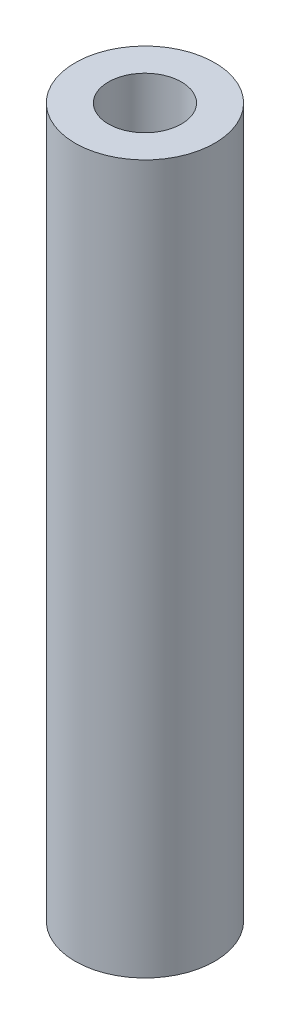
ISO-10303-21;
HEADER;
FILE_DESCRIPTION(('STEP AP214'),'2;1');
FILE_NAME('part.step','',(''),(''),'','','');
FILE_SCHEMA(('AUTOMOTIVE_DESIGN { 1 0 10303 214 1 1 1 1 }'));
ENDSEC;
DATA;
#1=APPLICATION_CONTEXT('core data for automotive mechanical design processes');
#2=APPLICATION_PROTOCOL_DEFINITION('international standard','automotive_design',2000,#1);
#3=PRODUCT_CONTEXT('',#1,'mechanical');
#4=PRODUCT('Part','Part','',(#3));
#5=PRODUCT_RELATED_PRODUCT_CATEGORY('part','',(#4));
#6=PRODUCT_DEFINITION_FORMATION('','',#4);
#7=PRODUCT_DEFINITION_CONTEXT('part definition',#1,'design');
#8=PRODUCT_DEFINITION('design','',#6,#7);
#9=PRODUCT_DEFINITION_SHAPE('','',#8);
#10=(LENGTH_UNIT() NAMED_UNIT(*) SI_UNIT(.MILLI.,.METRE.));
#11=(NAMED_UNIT(*) PLANE_ANGLE_UNIT() SI_UNIT($,.RADIAN.));
#12=(NAMED_UNIT(*) SI_UNIT($,.STERADIAN.) SOLID_ANGLE_UNIT());
#13=UNCERTAINTY_MEASURE_WITH_UNIT(LENGTH_MEASURE(1.E-05),#10,'distance_accuracy_value','');
#14=(GEOMETRIC_REPRESENTATION_CONTEXT(3) GLOBAL_UNCERTAINTY_ASSIGNED_CONTEXT((#13)) GLOBAL_UNIT_ASSIGNED_CONTEXT((#10,
#11,#12)) REPRESENTATION_CONTEXT('',''));
#15=CARTESIAN_POINT('',(0.,0.,0.));
#16=DIRECTION('',(0.,0.,1.));
#17=DIRECTION('',(1.,0.,0.));
#18=AXIS2_PLACEMENT_3D('',#15,#16,#17);
#19=CARTESIAN_POINT('',(0.,33.,0.));
#20=DIRECTION('',(0.,1.,0.));
#21=DIRECTION('',(0.,0.,1.));
#22=AXIS2_PLACEMENT_3D('',#19,#20,#21);
#23=PLANE('',#22);
#24=CARTESIAN_POINT('',(0.,33.,0.));
#25=DIRECTION('',(0.,1.,0.));
#26=DIRECTION('',(0.,0.,1.));
#27=AXIS2_PLACEMENT_3D('',#24,#25,#26);
#28=CIRCLE('',#27,3.25);
#29=CARTESIAN_POINT('',(0.,33.,3.25));
#30=VERTEX_POINT('',#29);
#31=EDGE_CURVE('E10',#30,#30,#28,.T.);
#32=ORIENTED_EDGE('',*,*,#31,.T.);
#33=EDGE_LOOP('',(#32));
#34=FACE_BOUND('',#33,.T.);
#35=CARTESIAN_POINT('',(0.,33.,0.));
#36=DIRECTION('',(0.,1.,0.));
#37=DIRECTION('',(0.,0.,1.));
#38=AXIS2_PLACEMENT_3D('',#35,#36,#37);
#39=CIRCLE('',#38,1.7);
#40=CARTESIAN_POINT('',(0.,33.,1.7));
#41=VERTEX_POINT('',#40);
#42=EDGE_CURVE('E45',#41,#41,#39,.T.);
#43=ORIENTED_EDGE('',*,*,#42,.F.);
#44=EDGE_LOOP('',(#43));
#45=FACE_BOUND('',#44,.T.);
#46=ADVANCED_FACE('F34',(#34,#45),#23,.T.);
#47=CARTESIAN_POINT('',(0.,0.,0.));
#48=DIRECTION('',(0.,1.,0.));
#49=DIRECTION('',(0.,0.,1.));
#50=AXIS2_PLACEMENT_3D('',#47,#48,#49);
#51=PLANE('',#50);
#52=CARTESIAN_POINT('',(0.,0.,0.));
#53=DIRECTION('',(0.,1.,0.));
#54=DIRECTION('',(0.,0.,1.));
#55=AXIS2_PLACEMENT_3D('',#52,#53,#54);
#56=CIRCLE('',#55,3.25);
#57=CARTESIAN_POINT('',(0.,0.,3.25));
#58=VERTEX_POINT('',#57);
#59=EDGE_CURVE('E38',#58,#58,#56,.T.);
#60=ORIENTED_EDGE('',*,*,#59,.F.);
#61=EDGE_LOOP('',(#60));
#62=FACE_BOUND('',#61,.T.);
#63=CARTESIAN_POINT('',(0.,0.,0.));
#64=DIRECTION('',(0.,1.,0.));
#65=DIRECTION('',(0.,0.,1.));
#66=AXIS2_PLACEMENT_3D('',#63,#64,#65);
#67=CIRCLE('',#66,1.7);
#68=CARTESIAN_POINT('',(0.,0.,1.7));
#69=VERTEX_POINT('',#68);
#70=EDGE_CURVE('E47',#69,#69,#67,.T.);
#71=ORIENTED_EDGE('',*,*,#70,.T.);
#72=EDGE_LOOP('',(#71));
#73=FACE_BOUND('',#72,.T.);
#74=ADVANCED_FACE('F57',(#62,#73),#51,.F.);
#75=CARTESIAN_POINT('',(0.,33.,0.));
#76=DIRECTION('',(0.,-1.,0.));
#77=DIRECTION('',(0.,0.,-1.));
#78=AXIS2_PLACEMENT_3D('',#75,#76,#77);
#79=CYLINDRICAL_SURFACE('',#78,3.25);
#80=ORIENTED_EDGE('',*,*,#31,.F.);
#81=EDGE_LOOP('',(#80));
#82=FACE_BOUND('',#81,.T.);
#83=ORIENTED_EDGE('',*,*,#59,.T.);
#84=EDGE_LOOP('',(#83));
#85=FACE_BOUND('',#84,.T.);
#86=ADVANCED_FACE('F36',(#82,#85),#79,.T.);
#87=CARTESIAN_POINT('',(0.,33.,0.));
#88=DIRECTION('',(0.,-1.,0.));
#89=DIRECTION('',(0.,0.,-1.));
#90=AXIS2_PLACEMENT_3D('',#87,#88,#89);
#91=CYLINDRICAL_SURFACE('',#90,1.7);
#92=ORIENTED_EDGE('',*,*,#42,.T.);
#93=EDGE_LOOP('',(#92));
#94=FACE_BOUND('',#93,.T.);
#95=ORIENTED_EDGE('',*,*,#70,.F.);
#96=EDGE_LOOP('',(#95));
#97=FACE_BOUND('',#96,.T.);
#98=ADVANCED_FACE('F53',(#94,#97),#91,.F.);
#99=CLOSED_SHELL('',(#46,#74,#86,#98));
#100=MANIFOLD_SOLID_BREP('B2',#99);
#101=ADVANCED_BREP_SHAPE_REPRESENTATION('',(#18,#100),#14);
#102=SHAPE_DEFINITION_REPRESENTATION(#9,#101);
ENDSEC;
END-ISO-10303-21;
